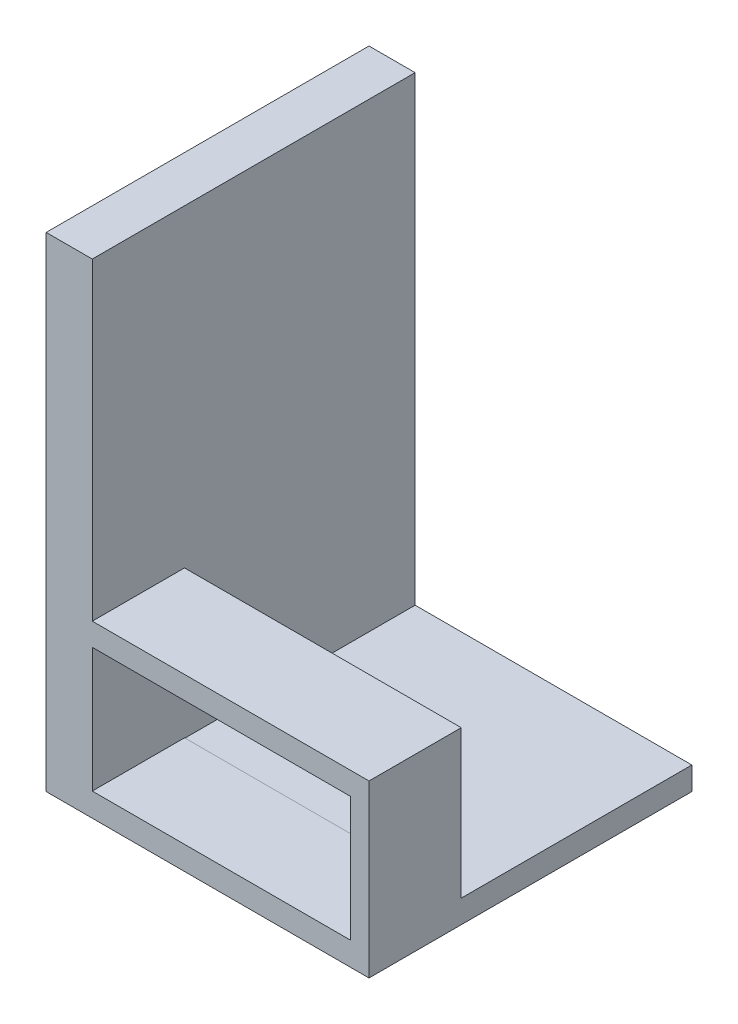
ISO-10303-21;
HEADER;
FILE_DESCRIPTION(('STEP AP214'),'2;1');
FILE_NAME('part.step','',(''),(''),'','','');
FILE_SCHEMA(('AUTOMOTIVE_DESIGN { 1 0 10303 214 1 1 1 1 }'));
ENDSEC;
DATA;
#1=APPLICATION_CONTEXT('core data for automotive mechanical design processes');
#2=APPLICATION_PROTOCOL_DEFINITION('international standard','automotive_design',2000,#1);
#3=PRODUCT_CONTEXT('',#1,'mechanical');
#4=PRODUCT('Part','Part','',(#3));
#5=PRODUCT_RELATED_PRODUCT_CATEGORY('part','',(#4));
#6=PRODUCT_DEFINITION_FORMATION('','',#4);
#7=PRODUCT_DEFINITION_CONTEXT('part definition',#1,'design');
#8=PRODUCT_DEFINITION('design','',#6,#7);
#9=PRODUCT_DEFINITION_SHAPE('','',#8);
#10=(LENGTH_UNIT() NAMED_UNIT(*) SI_UNIT(.MILLI.,.METRE.));
#11=(NAMED_UNIT(*) PLANE_ANGLE_UNIT() SI_UNIT($,.RADIAN.));
#12=(NAMED_UNIT(*) SI_UNIT($,.STERADIAN.) SOLID_ANGLE_UNIT());
#13=UNCERTAINTY_MEASURE_WITH_UNIT(LENGTH_MEASURE(1.E-05),#10,'distance_accuracy_value','');
#14=(GEOMETRIC_REPRESENTATION_CONTEXT(3) GLOBAL_UNCERTAINTY_ASSIGNED_CONTEXT((#13)) GLOBAL_UNIT_ASSIGNED_CONTEXT((#10,
#11,#12)) REPRESENTATION_CONTEXT('',''));
#15=CARTESIAN_POINT('',(0.,0.,0.));
#16=DIRECTION('',(0.,0.,1.));
#17=DIRECTION('',(1.,0.,0.));
#18=AXIS2_PLACEMENT_3D('',#15,#16,#17);
#19=CARTESIAN_POINT('',(0.,2.5,0.));
#20=DIRECTION('',(0.,-1.,0.));
#21=DIRECTION('',(0.,0.,-1.));
#22=AXIS2_PLACEMENT_3D('',#19,#20,#21);
#23=PLANE('',#22);
#24=DIRECTION('',(-1.,0.,0.));
#25=VECTOR('',#24,1.);
#26=CARTESIAN_POINT('',(4.99999999999999,2.5,-10.));
#27=LINE('',#26,#25);
#28=CARTESIAN_POINT('',(35.,2.5,-10.));
#29=VERTEX_POINT('',#28);
#30=CARTESIAN_POINT('',(4.99999999999999,2.5,-10.));
#31=VERTEX_POINT('',#30);
#32=EDGE_CURVE('E190',#29,#31,#27,.T.);
#33=ORIENTED_EDGE('',*,*,#32,.F.);
#34=DIRECTION('',(0.,0.,-1.));
#35=VECTOR('',#34,1.);
#36=CARTESIAN_POINT('',(35.,2.5,0.));
#37=LINE('',#36,#35);
#38=CARTESIAN_POINT('',(35.,2.5,-35.));
#39=VERTEX_POINT('',#38);
#40=EDGE_CURVE('E289',#29,#39,#37,.T.);
#41=ORIENTED_EDGE('',*,*,#40,.T.);
#42=DIRECTION('',(-1.,0.,0.));
#43=VECTOR('',#42,1.);
#44=CARTESIAN_POINT('',(0.,2.5,-35.));
#45=LINE('',#44,#43);
#46=CARTESIAN_POINT('',(4.99999999999999,2.5,-35.));
#47=VERTEX_POINT('',#46);
#48=EDGE_CURVE('E292',#39,#47,#45,.T.);
#49=ORIENTED_EDGE('',*,*,#48,.T.);
#50=DIRECTION('',(0.,0.,-1.));
#51=VECTOR('',#50,1.);
#52=CARTESIAN_POINT('',(4.99999999999999,2.5,-35.));
#53=LINE('',#52,#51);
#54=EDGE_CURVE('E255',#31,#47,#53,.T.);
#55=ORIENTED_EDGE('',*,*,#54,.F.);
#56=EDGE_LOOP('',(#33,#41,#49,#55));
#57=FACE_BOUND('',#56,.T.);
#58=ADVANCED_FACE('F45',(#57),#23,.F.);
#59=CARTESIAN_POINT('',(4.99999999999999,52.5,-35.));
#60=DIRECTION('',(-1.,0.,0.));
#61=DIRECTION('',(0.,0.,1.));
#62=AXIS2_PLACEMENT_3D('',#59,#60,#61);
#63=PLANE('',#62);
#64=DIRECTION('',(0.,0.,1.));
#65=VECTOR('',#64,1.);
#66=CARTESIAN_POINT('',(5.,2.55,-16.));
#67=LINE('',#66,#65);
#68=CARTESIAN_POINT('',(5.,2.55,-10.));
#69=VERTEX_POINT('',#68);
#70=CARTESIAN_POINT('',(5.,2.55,0.));
#71=VERTEX_POINT('',#70);
#72=EDGE_CURVE('E168',#69,#71,#67,.T.);
#73=ORIENTED_EDGE('',*,*,#72,.F.);
#74=DIRECTION('',(0.,-1.,0.));
#75=VECTOR('',#74,1.);
#76=CARTESIAN_POINT('',(4.99999999999999,18.5,-10.));
#77=LINE('',#76,#75);
#78=EDGE_CURVE('E210',#69,#31,#77,.T.);
#79=ORIENTED_EDGE('',*,*,#78,.T.);
#80=ORIENTED_EDGE('',*,*,#54,.T.);
#81=DIRECTION('',(0.,-1.,0.));
#82=VECTOR('',#81,1.);
#83=CARTESIAN_POINT('',(4.99999999999999,52.5,-35.));
#84=LINE('',#83,#82);
#85=CARTESIAN_POINT('',(4.99999999999999,52.5,-35.));
#86=VERTEX_POINT('',#85);
#87=EDGE_CURVE('E279',#86,#47,#84,.T.);
#88=ORIENTED_EDGE('',*,*,#87,.F.);
#89=DIRECTION('',(0.,0.,-1.));
#90=VECTOR('',#89,1.);
#91=CARTESIAN_POINT('',(4.99999999999999,52.5,-35.));
#92=LINE('',#91,#90);
#93=CARTESIAN_POINT('',(4.99999999999999,52.5,0.));
#94=VERTEX_POINT('',#93);
#95=EDGE_CURVE('E272',#94,#86,#92,.T.);
#96=ORIENTED_EDGE('',*,*,#95,.F.);
#97=DIRECTION('',(0.,-1.,0.));
#98=VECTOR('',#97,1.);
#99=CARTESIAN_POINT('',(4.99999999999999,52.5,0.));
#100=LINE('',#99,#98);
#101=CARTESIAN_POINT('',(4.99999999999999,18.5,0.));
#102=VERTEX_POINT('',#101);
#103=EDGE_CURVE('E285',#94,#102,#100,.T.);
#104=ORIENTED_EDGE('',*,*,#103,.T.);
#105=DIRECTION('',(0.,0.,1.));
#106=VECTOR('',#105,1.);
#107=CARTESIAN_POINT('',(4.99999999999999,18.5,0.));
#108=LINE('',#107,#106);
#109=CARTESIAN_POINT('',(4.99999999999999,18.5,-10.));
#110=VERTEX_POINT('',#109);
#111=EDGE_CURVE('E195',#110,#102,#108,.T.);
#112=ORIENTED_EDGE('',*,*,#111,.F.);
#113=CARTESIAN_POINT('',(4.99999999999999,16.05,-10.));
#114=VERTEX_POINT('',#113);
#115=EDGE_CURVE('E166',#110,#114,#77,.T.);
#116=ORIENTED_EDGE('',*,*,#115,.T.);
#117=DIRECTION('',(0.,0.,1.));
#118=VECTOR('',#117,1.);
#119=CARTESIAN_POINT('',(5.,16.05,-16.));
#120=LINE('',#119,#118);
#121=CARTESIAN_POINT('',(5.,16.05,0.));
#122=VERTEX_POINT('',#121);
#123=EDGE_CURVE('E69',#114,#122,#120,.T.);
#124=ORIENTED_EDGE('',*,*,#123,.T.);
#125=DIRECTION('',(0.,-1.,0.));
#126=VECTOR('',#125,1.);
#127=CARTESIAN_POINT('',(5.,2.55,0.));
#128=LINE('',#127,#126);
#129=EDGE_CURVE('E163',#122,#71,#128,.T.);
#130=ORIENTED_EDGE('',*,*,#129,.T.);
#131=EDGE_LOOP('',(#73,#79,#80,#88,#96,#104,#112,#116,#124,#130));
#132=FACE_BOUND('',#131,.T.);
#133=ADVANCED_FACE('F161',(#132),#63,.F.);
#134=CARTESIAN_POINT('',(0.,2.5,0.));
#135=DIRECTION('',(1.,0.,0.));
#136=DIRECTION('',(0.,0.,-1.));
#137=AXIS2_PLACEMENT_3D('',#134,#135,#136);
#138=PLANE('',#137);
#139=DIRECTION('',(0.,0.,1.));
#140=VECTOR('',#139,1.);
#141=CARTESIAN_POINT('',(0.,12.5,-26.0538512246076));
#142=LINE('',#141,#140);
#143=CARTESIAN_POINT('',(0.,12.5,-26.0538512246076));
#144=VERTEX_POINT('',#143);
#145=CARTESIAN_POINT('',(0.,12.5,-9.05385122460765));
#146=VERTEX_POINT('',#145);
#147=EDGE_CURVE('E241',#144,#146,#142,.T.);
#148=ORIENTED_EDGE('',*,*,#147,.F.);
#149=DIRECTION('',(0.,-1.,0.));
#150=VECTOR('',#149,1.);
#151=CARTESIAN_POINT('',(0.,47.5,-26.0538512246077));
#152=LINE('',#151,#150);
#153=CARTESIAN_POINT('',(0.,47.5,-26.0538512246077));
#154=VERTEX_POINT('',#153);
#155=EDGE_CURVE('E220',#154,#144,#152,.T.);
#156=ORIENTED_EDGE('',*,*,#155,.F.);
#157=DIRECTION('',(0.,0.,-1.));
#158=VECTOR('',#157,1.);
#159=CARTESIAN_POINT('',(0.,47.5,-26.0538512246077));
#160=LINE('',#159,#158);
#161=CARTESIAN_POINT('',(0.,47.5,-9.05385122460765));
#162=VERTEX_POINT('',#161);
#163=EDGE_CURVE('E226',#162,#154,#160,.T.);
#164=ORIENTED_EDGE('',*,*,#163,.F.);
#165=DIRECTION('',(0.,1.,0.));
#166=VECTOR('',#165,1.);
#167=CARTESIAN_POINT('',(0.,47.5,-9.05385122460765));
#168=LINE('',#167,#166);
#169=EDGE_CURVE('E245',#146,#162,#168,.T.);
#170=ORIENTED_EDGE('',*,*,#169,.F.);
#171=EDGE_LOOP('',(#148,#156,#164,#170));
#172=FACE_BOUND('',#171,.T.);
#173=DIRECTION('',(0.,0.,1.));
#174=VECTOR('',#173,1.);
#175=CARTESIAN_POINT('',(0.,0.,0.));
#176=LINE('',#175,#174);
#177=CARTESIAN_POINT('',(0.,0.,-35.));
#178=VERTEX_POINT('',#177);
#179=CARTESIAN_POINT('',(0.,0.,0.));
#180=VERTEX_POINT('',#179);
#181=EDGE_CURVE('E288',#178,#180,#176,.T.);
#182=ORIENTED_EDGE('',*,*,#181,.T.);
#183=DIRECTION('',(0.,-1.,0.));
#184=VECTOR('',#183,1.);
#185=CARTESIAN_POINT('',(0.,2.5,0.));
#186=LINE('',#185,#184);
#187=CARTESIAN_POINT('',(0.,52.5,0.));
#188=VERTEX_POINT('',#187);
#189=EDGE_CURVE('E320',#188,#180,#186,.T.);
#190=ORIENTED_EDGE('',*,*,#189,.F.);
#191=DIRECTION('',(0.,0.,1.));
#192=VECTOR('',#191,1.);
#193=CARTESIAN_POINT('',(0.,52.5,-35.));
#194=LINE('',#193,#192);
#195=CARTESIAN_POINT('',(0.,52.5,-35.));
#196=VERTEX_POINT('',#195);
#197=EDGE_CURVE('E265',#196,#188,#194,.T.);
#198=ORIENTED_EDGE('',*,*,#197,.F.);
#199=DIRECTION('',(0.,-1.,0.));
#200=VECTOR('',#199,1.);
#201=CARTESIAN_POINT('',(0.,2.5,-35.));
#202=LINE('',#201,#200);
#203=EDGE_CURVE('E297',#196,#178,#202,.T.);
#204=ORIENTED_EDGE('',*,*,#203,.T.);
#205=EDGE_LOOP('',(#182,#190,#198,#204));
#206=FACE_BOUND('',#205,.T.);
#207=ADVANCED_FACE('F47',(#172,#206),#138,.F.);
#208=CARTESIAN_POINT('',(0.,2.5,0.));
#209=DIRECTION('',(0.,0.,-1.));
#210=DIRECTION('',(-1.,0.,0.));
#211=AXIS2_PLACEMENT_3D('',#208,#209,#210);
#212=PLANE('',#211);
#213=DIRECTION('',(-1.,0.,0.));
#214=VECTOR('',#213,1.);
#215=CARTESIAN_POINT('',(33.,16.05,0.));
#216=LINE('',#215,#214);
#217=CARTESIAN_POINT('',(33.,16.05,0.));
#218=VERTEX_POINT('',#217);
#219=EDGE_CURVE('E172',#218,#122,#216,.T.);
#220=ORIENTED_EDGE('',*,*,#219,.F.);
#221=DIRECTION('',(0.,1.,0.));
#222=VECTOR('',#221,1.);
#223=CARTESIAN_POINT('',(33.,2.55,0.));
#224=LINE('',#223,#222);
#225=CARTESIAN_POINT('',(33.,2.55,0.));
#226=VERTEX_POINT('',#225);
#227=EDGE_CURVE('E61',#226,#218,#224,.T.);
#228=ORIENTED_EDGE('',*,*,#227,.F.);
#229=DIRECTION('',(1.,0.,0.));
#230=VECTOR('',#229,1.);
#231=CARTESIAN_POINT('',(33.,2.55,0.));
#232=LINE('',#231,#230);
#233=EDGE_CURVE('E180',#71,#226,#232,.T.);
#234=ORIENTED_EDGE('',*,*,#233,.F.);
#235=ORIENTED_EDGE('',*,*,#129,.F.);
#236=EDGE_LOOP('',(#220,#228,#234,#235));
#237=FACE_BOUND('',#236,.T.);
#238=DIRECTION('',(0.,-1.,0.));
#239=VECTOR('',#238,1.);
#240=CARTESIAN_POINT('',(35.,2.5,0.));
#241=LINE('',#240,#239);
#242=CARTESIAN_POINT('',(35.,18.5,0.));
#243=VERTEX_POINT('',#242);
#244=CARTESIAN_POINT('',(35.,0.,0.));
#245=VERTEX_POINT('',#244);
#246=EDGE_CURVE('E316',#243,#245,#241,.T.);
#247=ORIENTED_EDGE('',*,*,#246,.F.);
#248=DIRECTION('',(1.,0.,0.));
#249=VECTOR('',#248,1.);
#250=CARTESIAN_POINT('',(4.99999999999999,18.5,0.));
#251=LINE('',#250,#249);
#252=EDGE_CURVE('E199',#102,#243,#251,.T.);
#253=ORIENTED_EDGE('',*,*,#252,.F.);
#254=ORIENTED_EDGE('',*,*,#103,.F.);
#255=DIRECTION('',(1.,0.,0.));
#256=VECTOR('',#255,1.);
#257=CARTESIAN_POINT('',(0.,52.5,0.));
#258=LINE('',#257,#256);
#259=EDGE_CURVE('E269',#188,#94,#258,.T.);
#260=ORIENTED_EDGE('',*,*,#259,.F.);
#261=ORIENTED_EDGE('',*,*,#189,.T.);
#262=DIRECTION('',(1.,0.,0.));
#263=VECTOR('',#262,1.);
#264=CARTESIAN_POINT('',(0.,0.,0.));
#265=LINE('',#264,#263);
#266=EDGE_CURVE('E301',#180,#245,#265,.T.);
#267=ORIENTED_EDGE('',*,*,#266,.T.);
#268=EDGE_LOOP('',(#247,#253,#254,#260,#261,#267));
#269=FACE_BOUND('',#268,.T.);
#270=ADVANCED_FACE('F177',(#237,#269),#212,.F.);
#271=CARTESIAN_POINT('',(35.,2.5,0.));
#272=DIRECTION('',(-1.,0.,0.));
#273=DIRECTION('',(0.,0.,1.));
#274=AXIS2_PLACEMENT_3D('',#271,#272,#273);
#275=PLANE('',#274);
#276=DIRECTION('',(0.,0.,-1.));
#277=VECTOR('',#276,1.);
#278=CARTESIAN_POINT('',(35.,0.,0.));
#279=LINE('',#278,#277);
#280=CARTESIAN_POINT('',(35.,0.,-35.));
#281=VERTEX_POINT('',#280);
#282=EDGE_CURVE('E304',#245,#281,#279,.T.);
#283=ORIENTED_EDGE('',*,*,#282,.T.);
#284=DIRECTION('',(0.,-1.,0.));
#285=VECTOR('',#284,1.);
#286=CARTESIAN_POINT('',(35.,2.5,-35.));
#287=LINE('',#286,#285);
#288=EDGE_CURVE('E312',#39,#281,#287,.T.);
#289=ORIENTED_EDGE('',*,*,#288,.F.);
#290=ORIENTED_EDGE('',*,*,#40,.F.);
#291=DIRECTION('',(0.,-1.,0.));
#292=VECTOR('',#291,1.);
#293=CARTESIAN_POINT('',(35.,18.5,-10.));
#294=LINE('',#293,#292);
#295=CARTESIAN_POINT('',(35.,18.5,-10.));
#296=VERTEX_POINT('',#295);
#297=EDGE_CURVE('E216',#296,#29,#294,.T.);
#298=ORIENTED_EDGE('',*,*,#297,.F.);
#299=DIRECTION('',(0.,0.,-1.));
#300=VECTOR('',#299,1.);
#301=CARTESIAN_POINT('',(35.,18.5,0.));
#302=LINE('',#301,#300);
#303=EDGE_CURVE('E203',#243,#296,#302,.T.);
#304=ORIENTED_EDGE('',*,*,#303,.F.);
#305=ORIENTED_EDGE('',*,*,#246,.T.);
#306=EDGE_LOOP('',(#283,#289,#290,#298,#304,#305));
#307=FACE_BOUND('',#306,.T.);
#308=ADVANCED_FACE('F344',(#307),#275,.F.);
#309=CARTESIAN_POINT('',(0.,2.5,-35.));
#310=DIRECTION('',(0.,0.,1.));
#311=DIRECTION('',(1.,0.,0.));
#312=AXIS2_PLACEMENT_3D('',#309,#310,#311);
#313=PLANE('',#312);
#314=DIRECTION('',(-1.,0.,0.));
#315=VECTOR('',#314,1.);
#316=CARTESIAN_POINT('',(0.,0.,-35.));
#317=LINE('',#316,#315);
#318=EDGE_CURVE('E293',#281,#178,#317,.T.);
#319=ORIENTED_EDGE('',*,*,#318,.T.);
#320=ORIENTED_EDGE('',*,*,#203,.F.);
#321=DIRECTION('',(-1.,0.,0.));
#322=VECTOR('',#321,1.);
#323=CARTESIAN_POINT('',(0.,52.5,-35.));
#324=LINE('',#323,#322);
#325=EDGE_CURVE('E275',#86,#196,#324,.T.);
#326=ORIENTED_EDGE('',*,*,#325,.F.);
#327=ORIENTED_EDGE('',*,*,#87,.T.);
#328=ORIENTED_EDGE('',*,*,#48,.F.);
#329=ORIENTED_EDGE('',*,*,#288,.T.);
#330=EDGE_LOOP('',(#319,#320,#326,#327,#328,#329));
#331=FACE_BOUND('',#330,.T.);
#332=ADVANCED_FACE('F350',(#331),#313,.F.);
#333=CARTESIAN_POINT('',(0.,0.,0.));
#334=DIRECTION('',(0.,-1.,0.));
#335=DIRECTION('',(0.,0.,-1.));
#336=AXIS2_PLACEMENT_3D('',#333,#334,#335);
#337=PLANE('',#336);
#338=ORIENTED_EDGE('',*,*,#181,.F.);
#339=ORIENTED_EDGE('',*,*,#318,.F.);
#340=ORIENTED_EDGE('',*,*,#282,.F.);
#341=ORIENTED_EDGE('',*,*,#266,.F.);
#342=EDGE_LOOP('',(#338,#339,#340,#341));
#343=FACE_BOUND('',#342,.T.);
#344=ADVANCED_FACE('F364',(#343),#337,.T.);
#345=CARTESIAN_POINT('',(0.,52.5,0.));
#346=DIRECTION('',(0.,1.,0.));
#347=DIRECTION('',(0.,0.,1.));
#348=AXIS2_PLACEMENT_3D('',#345,#346,#347);
#349=PLANE('',#348);
#350=ORIENTED_EDGE('',*,*,#197,.T.);
#351=ORIENTED_EDGE('',*,*,#259,.T.);
#352=ORIENTED_EDGE('',*,*,#95,.T.);
#353=ORIENTED_EDGE('',*,*,#325,.T.);
#354=EDGE_LOOP('',(#350,#351,#352,#353));
#355=FACE_BOUND('',#354,.T.);
#356=ADVANCED_FACE('F357',(#355),#349,.T.);
#357=CARTESIAN_POINT('',(3.99999999999999,47.5,-26.0538512246077));
#358=DIRECTION('',(0.,0.,-1.));
#359=DIRECTION('',(-1.,0.,0.));
#360=AXIS2_PLACEMENT_3D('',#357,#358,#359);
#361=PLANE('',#360);
#362=ORIENTED_EDGE('',*,*,#155,.T.);
#363=DIRECTION('',(-1.,0.,0.));
#364=VECTOR('',#363,1.);
#365=CARTESIAN_POINT('',(3.99999999999999,12.5,-26.0538512246076));
#366=LINE('',#365,#364);
#367=CARTESIAN_POINT('',(3.99999999999999,12.5,-26.0538512246076));
#368=VERTEX_POINT('',#367);
#369=EDGE_CURVE('E238',#368,#144,#366,.T.);
#370=ORIENTED_EDGE('',*,*,#369,.F.);
#371=DIRECTION('',(0.,-1.,0.));
#372=VECTOR('',#371,1.);
#373=CARTESIAN_POINT('',(3.99999999999999,47.5,-26.0538512246077));
#374=LINE('',#373,#372);
#375=CARTESIAN_POINT('',(3.99999999999999,47.5,-26.0538512246077));
#376=VERTEX_POINT('',#375);
#377=EDGE_CURVE('E221',#376,#368,#374,.T.);
#378=ORIENTED_EDGE('',*,*,#377,.F.);
#379=DIRECTION('',(-1.,0.,0.));
#380=VECTOR('',#379,1.);
#381=CARTESIAN_POINT('',(3.99999999999999,47.5,-26.0538512246077));
#382=LINE('',#381,#380);
#383=EDGE_CURVE('E252',#376,#154,#382,.T.);
#384=ORIENTED_EDGE('',*,*,#383,.T.);
#385=EDGE_LOOP('',(#362,#370,#378,#384));
#386=FACE_BOUND('',#385,.T.);
#387=ADVANCED_FACE('F483',(#386),#361,.F.);
#388=CARTESIAN_POINT('',(3.99999999999999,47.5,-26.0538512246077));
#389=DIRECTION('',(0.,1.,0.));
#390=DIRECTION('',(0.,0.,1.));
#391=AXIS2_PLACEMENT_3D('',#388,#389,#390);
#392=PLANE('',#391);
#393=ORIENTED_EDGE('',*,*,#163,.T.);
#394=ORIENTED_EDGE('',*,*,#383,.F.);
#395=DIRECTION('',(0.,0.,-1.));
#396=VECTOR('',#395,1.);
#397=CARTESIAN_POINT('',(3.99999999999999,47.5,-26.0538512246077));
#398=LINE('',#397,#396);
#399=CARTESIAN_POINT('',(4.,47.5,-9.05385122460765));
#400=VERTEX_POINT('',#399);
#401=EDGE_CURVE('E234',#400,#376,#398,.T.);
#402=ORIENTED_EDGE('',*,*,#401,.F.);
#403=DIRECTION('',(-1.,0.,0.));
#404=VECTOR('',#403,1.);
#405=CARTESIAN_POINT('',(4.,47.5,-9.05385122460765));
#406=LINE('',#405,#404);
#407=EDGE_CURVE('E256',#400,#162,#406,.T.);
#408=ORIENTED_EDGE('',*,*,#407,.T.);
#409=EDGE_LOOP('',(#393,#394,#402,#408));
#410=FACE_BOUND('',#409,.T.);
#411=ADVANCED_FACE('F474',(#410),#392,.F.);
#412=CARTESIAN_POINT('',(4.,47.5,-9.05385122460765));
#413=DIRECTION('',(0.,0.,1.));
#414=DIRECTION('',(1.,0.,0.));
#415=AXIS2_PLACEMENT_3D('',#412,#413,#414);
#416=PLANE('',#415);
#417=ORIENTED_EDGE('',*,*,#169,.T.);
#418=ORIENTED_EDGE('',*,*,#407,.F.);
#419=DIRECTION('',(0.,1.,0.));
#420=VECTOR('',#419,1.);
#421=CARTESIAN_POINT('',(4.,47.5,-9.05385122460765));
#422=LINE('',#421,#420);
#423=CARTESIAN_POINT('',(4.,12.5,-9.05385122460765));
#424=VERTEX_POINT('',#423);
#425=EDGE_CURVE('E230',#424,#400,#422,.T.);
#426=ORIENTED_EDGE('',*,*,#425,.F.);
#427=DIRECTION('',(-1.,0.,0.));
#428=VECTOR('',#427,1.);
#429=CARTESIAN_POINT('',(4.,12.5,-9.05385122460765));
#430=LINE('',#429,#428);
#431=EDGE_CURVE('E259',#424,#146,#430,.T.);
#432=ORIENTED_EDGE('',*,*,#431,.T.);
#433=EDGE_LOOP('',(#417,#418,#426,#432));
#434=FACE_BOUND('',#433,.T.);
#435=ADVANCED_FACE('F465',(#434),#416,.F.);
#436=CARTESIAN_POINT('',(3.99999999999999,12.5,-26.0538512246076));
#437=DIRECTION('',(0.,-1.,0.));
#438=DIRECTION('',(0.,0.,-1.));
#439=AXIS2_PLACEMENT_3D('',#436,#437,#438);
#440=PLANE('',#439);
#441=ORIENTED_EDGE('',*,*,#147,.T.);
#442=ORIENTED_EDGE('',*,*,#431,.F.);
#443=DIRECTION('',(0.,0.,1.));
#444=VECTOR('',#443,1.);
#445=CARTESIAN_POINT('',(3.99999999999999,12.5,-26.0538512246076));
#446=LINE('',#445,#444);
#447=EDGE_CURVE('E225',#368,#424,#446,.T.);
#448=ORIENTED_EDGE('',*,*,#447,.F.);
#449=ORIENTED_EDGE('',*,*,#369,.T.);
#450=EDGE_LOOP('',(#441,#442,#448,#449));
#451=FACE_BOUND('',#450,.T.);
#452=ADVANCED_FACE('F456',(#451),#440,.F.);
#453=CARTESIAN_POINT('',(4.,0.,0.));
#454=DIRECTION('',(-1.,0.,0.));
#455=DIRECTION('',(0.,0.,1.));
#456=AXIS2_PLACEMENT_3D('',#453,#454,#455);
#457=PLANE('',#456);
#458=ORIENTED_EDGE('',*,*,#377,.T.);
#459=ORIENTED_EDGE('',*,*,#447,.T.);
#460=ORIENTED_EDGE('',*,*,#425,.T.);
#461=ORIENTED_EDGE('',*,*,#401,.T.);
#462=EDGE_LOOP('',(#458,#459,#460,#461));
#463=FACE_BOUND('',#462,.T.);
#464=ADVANCED_FACE('F415',(#463),#457,.T.);
#465=CARTESIAN_POINT('',(4.99999999999999,18.5,-10.));
#466=DIRECTION('',(0.,0.,1.));
#467=DIRECTION('',(1.,0.,0.));
#468=AXIS2_PLACEMENT_3D('',#465,#466,#467);
#469=PLANE('',#468);
#470=ORIENTED_EDGE('',*,*,#78,.F.);
#471=DIRECTION('',(1.,0.,0.));
#472=VECTOR('',#471,1.);
#473=CARTESIAN_POINT('',(4.99999999999999,2.55,-10.));
#474=LINE('',#473,#472);
#475=CARTESIAN_POINT('',(33.,2.55,-10.));
#476=VERTEX_POINT('',#475);
#477=EDGE_CURVE('E11',#69,#476,#474,.T.);
#478=ORIENTED_EDGE('',*,*,#477,.T.);
#479=DIRECTION('',(0.,1.,0.));
#480=VECTOR('',#479,1.);
#481=CARTESIAN_POINT('',(33.,18.5,-10.));
#482=LINE('',#481,#480);
#483=CARTESIAN_POINT('',(33.,16.05,-10.));
#484=VERTEX_POINT('',#483);
#485=EDGE_CURVE('E54',#476,#484,#482,.T.);
#486=ORIENTED_EDGE('',*,*,#485,.T.);
#487=DIRECTION('',(-1.,0.,0.));
#488=VECTOR('',#487,1.);
#489=CARTESIAN_POINT('',(4.99999999999999,16.05,-10.));
#490=LINE('',#489,#488);
#491=EDGE_CURVE('E324',#484,#114,#490,.T.);
#492=ORIENTED_EDGE('',*,*,#491,.T.);
#493=ORIENTED_EDGE('',*,*,#115,.F.);
#494=DIRECTION('',(-1.,0.,0.));
#495=VECTOR('',#494,1.);
#496=CARTESIAN_POINT('',(4.99999999999999,18.5,-10.));
#497=LINE('',#496,#495);
#498=EDGE_CURVE('E206',#296,#110,#497,.T.);
#499=ORIENTED_EDGE('',*,*,#498,.F.);
#500=ORIENTED_EDGE('',*,*,#297,.T.);
#501=ORIENTED_EDGE('',*,*,#32,.T.);
#502=EDGE_LOOP('',(#470,#478,#486,#492,#493,#499,#500,#501));
#503=FACE_BOUND('',#502,.T.);
#504=ADVANCED_FACE('F330',(#503),#469,.F.);
#505=CARTESIAN_POINT('',(0.,18.5,0.));
#506=DIRECTION('',(0.,-1.,0.));
#507=DIRECTION('',(0.,0.,-1.));
#508=AXIS2_PLACEMENT_3D('',#505,#506,#507);
#509=PLANE('',#508);
#510=ORIENTED_EDGE('',*,*,#111,.T.);
#511=ORIENTED_EDGE('',*,*,#252,.T.);
#512=ORIENTED_EDGE('',*,*,#303,.T.);
#513=ORIENTED_EDGE('',*,*,#498,.T.);
#514=EDGE_LOOP('',(#510,#511,#512,#513));
#515=FACE_BOUND('',#514,.T.);
#516=ADVANCED_FACE('F361',(#515),#509,.F.);
#517=CARTESIAN_POINT('',(33.,2.55,-16.));
#518=DIRECTION('',(1.,0.,0.));
#519=DIRECTION('',(0.,1.,0.));
#520=AXIS2_PLACEMENT_3D('',#517,#518,#519);
#521=PLANE('',#520);
#522=DIRECTION('',(0.,0.,1.));
#523=VECTOR('',#522,1.);
#524=CARTESIAN_POINT('',(33.,2.55,-16.));
#525=LINE('',#524,#523);
#526=EDGE_CURVE('E187',#476,#226,#525,.T.);
#527=ORIENTED_EDGE('',*,*,#526,.T.);
#528=ORIENTED_EDGE('',*,*,#227,.T.);
#529=DIRECTION('',(0.,0.,1.));
#530=VECTOR('',#529,1.);
#531=CARTESIAN_POINT('',(33.,16.05,-16.));
#532=LINE('',#531,#530);
#533=EDGE_CURVE('E169',#484,#218,#532,.T.);
#534=ORIENTED_EDGE('',*,*,#533,.F.);
#535=ORIENTED_EDGE('',*,*,#485,.F.);
#536=EDGE_LOOP('',(#527,#528,#534,#535));
#537=FACE_BOUND('',#536,.T.);
#538=ADVANCED_FACE('F332',(#537),#521,.F.);
#539=CARTESIAN_POINT('',(33.,2.55,-16.));
#540=DIRECTION('',(0.,-1.,0.));
#541=DIRECTION('',(1.,0.,0.));
#542=AXIS2_PLACEMENT_3D('',#539,#540,#541);
#543=PLANE('',#542);
#544=ORIENTED_EDGE('',*,*,#72,.T.);
#545=ORIENTED_EDGE('',*,*,#233,.T.);
#546=ORIENTED_EDGE('',*,*,#526,.F.);
#547=ORIENTED_EDGE('',*,*,#477,.F.);
#548=EDGE_LOOP('',(#544,#545,#546,#547));
#549=FACE_BOUND('',#548,.T.);
#550=ADVANCED_FACE('F334',(#549),#543,.F.);
#551=CARTESIAN_POINT('',(33.,16.05,-16.));
#552=DIRECTION('',(0.,1.,0.));
#553=DIRECTION('',(-1.,0.,0.));
#554=AXIS2_PLACEMENT_3D('',#551,#552,#553);
#555=PLANE('',#554);
#556=ORIENTED_EDGE('',*,*,#533,.T.);
#557=ORIENTED_EDGE('',*,*,#219,.T.);
#558=ORIENTED_EDGE('',*,*,#123,.F.);
#559=ORIENTED_EDGE('',*,*,#491,.F.);
#560=EDGE_LOOP('',(#556,#557,#558,#559));
#561=FACE_BOUND('',#560,.T.);
#562=ADVANCED_FACE('F173',(#561),#555,.F.);
#563=CLOSED_SHELL('',(#58,#133,#207,#270,#308,#332,#344,#356,#387,#411,#435,#452,#464,#504,#516,
#538,#550,#562));
#564=MANIFOLD_SOLID_BREP('B2',#563);
#565=ADVANCED_BREP_SHAPE_REPRESENTATION('',(#18,#564),#14);
#566=SHAPE_DEFINITION_REPRESENTATION(#9,#565);
ENDSEC;
END-ISO-10303-21;
